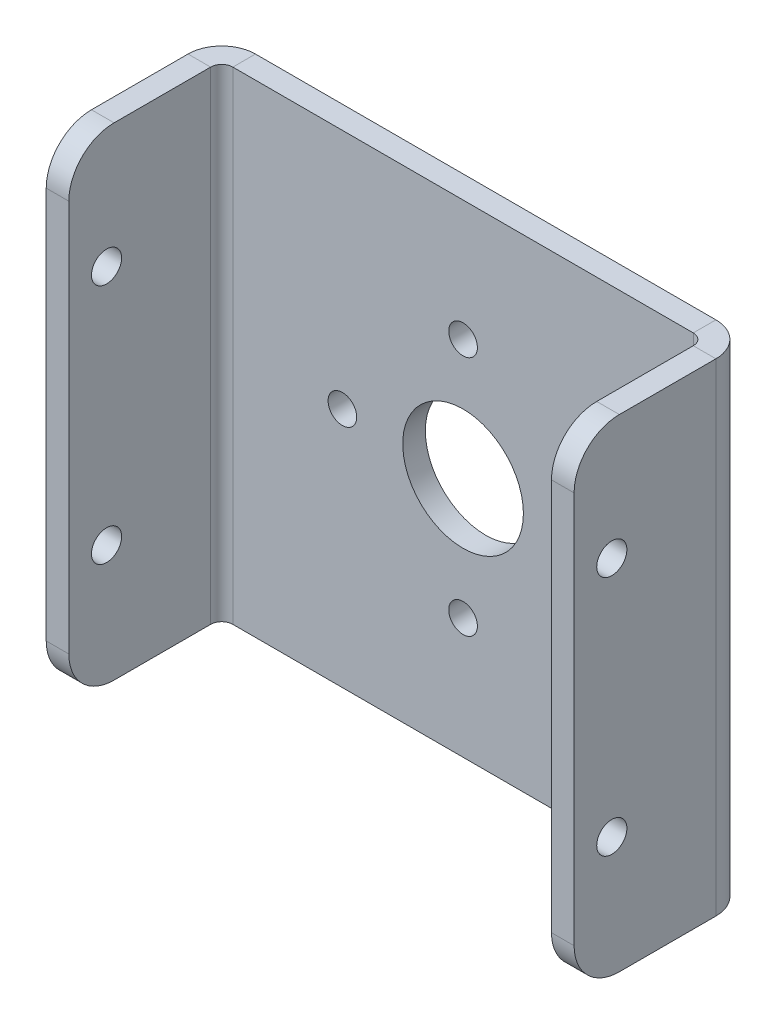
ISO-10303-21;
HEADER;
FILE_DESCRIPTION(('STEP AP214'),'2;1');
FILE_NAME('part.step','',(''),(''),'','','');
FILE_SCHEMA(('AUTOMOTIVE_DESIGN { 1 0 10303 214 1 1 1 1 }'));
ENDSEC;
DATA;
#1=APPLICATION_CONTEXT('core data for automotive mechanical design processes');
#2=APPLICATION_PROTOCOL_DEFINITION('international standard','automotive_design',2000,#1);
#3=PRODUCT_CONTEXT('',#1,'mechanical');
#4=PRODUCT('Part','Part','',(#3));
#5=PRODUCT_RELATED_PRODUCT_CATEGORY('part','',(#4));
#6=PRODUCT_DEFINITION_FORMATION('','',#4);
#7=PRODUCT_DEFINITION_CONTEXT('part definition',#1,'design');
#8=PRODUCT_DEFINITION('design','',#6,#7);
#9=PRODUCT_DEFINITION_SHAPE('','',#8);
#10=(LENGTH_UNIT() NAMED_UNIT(*) SI_UNIT(.MILLI.,.METRE.));
#11=(NAMED_UNIT(*) PLANE_ANGLE_UNIT() SI_UNIT($,.RADIAN.));
#12=(NAMED_UNIT(*) SI_UNIT($,.STERADIAN.) SOLID_ANGLE_UNIT());
#13=UNCERTAINTY_MEASURE_WITH_UNIT(LENGTH_MEASURE(1.E-05),#10,'distance_accuracy_value','');
#14=(GEOMETRIC_REPRESENTATION_CONTEXT(3) GLOBAL_UNCERTAINTY_ASSIGNED_CONTEXT((#13)) GLOBAL_UNIT_ASSIGNED_CONTEXT((#10,
#11,#12)) REPRESENTATION_CONTEXT('',''));
#15=CARTESIAN_POINT('',(0.,0.,0.));
#16=DIRECTION('',(0.,0.,1.));
#17=DIRECTION('',(1.,0.,0.));
#18=AXIS2_PLACEMENT_3D('',#15,#16,#17);
#19=CARTESIAN_POINT('',(24.,13.,-1.5));
#20=DIRECTION('',(0.,0.,-1.));
#21=DIRECTION('',(-1.,0.,0.));
#22=AXIS2_PLACEMENT_3D('',#19,#20,#21);
#23=PLANE('',#22);
#24=CARTESIAN_POINT('',(-7.99999999999977,-2.27373675443232E-13,-1.5));
#25=DIRECTION('',(0.,0.,-1.));
#26=DIRECTION('',(-1.,0.,0.));
#27=AXIS2_PLACEMENT_3D('',#24,#25,#26);
#28=CIRCLE('',#27,0.950000000000363);
#29=CARTESIAN_POINT('',(-8.95000000000014,-2.27373675443232E-13,-1.5));
#30=VERTEX_POINT('',#29);
#31=EDGE_CURVE('E487',#30,#30,#28,.T.);
#32=ORIENTED_EDGE('',*,*,#31,.F.);
#33=EDGE_LOOP('',(#32));
#34=FACE_BOUND('',#33,.T.);
#35=CARTESIAN_POINT('',(4.52787916007828E-13,-8.,-1.5));
#36=DIRECTION('',(0.,0.,-1.));
#37=DIRECTION('',(-1.,0.,0.));
#38=AXIS2_PLACEMENT_3D('',#35,#36,#37);
#39=CIRCLE('',#38,0.950000000000486);
#40=CARTESIAN_POINT('',(-0.950000000000033,-8.,-1.5));
#41=VERTEX_POINT('',#40);
#42=EDGE_CURVE('E474',#41,#41,#39,.T.);
#43=ORIENTED_EDGE('',*,*,#42,.F.);
#44=EDGE_LOOP('',(#43));
#45=FACE_BOUND('',#44,.T.);
#46=CARTESIAN_POINT('',(8.00000000000023,2.26393958003914E-13,-1.5));
#47=DIRECTION('',(0.,0.,-1.));
#48=DIRECTION('',(-1.,0.,0.));
#49=AXIS2_PLACEMENT_3D('',#46,#47,#48);
#50=CIRCLE('',#49,0.950000000000177);
#51=CARTESIAN_POINT('',(7.05000000000005,2.26393958003914E-13,-1.5));
#52=VERTEX_POINT('',#51);
#53=EDGE_CURVE('E483',#52,#52,#50,.T.);
#54=ORIENTED_EDGE('',*,*,#53,.F.);
#55=EDGE_LOOP('',(#54));
#56=FACE_BOUND('',#55,.T.);
#57=CARTESIAN_POINT('',(0.,8.,-1.5));
#58=DIRECTION('',(0.,0.,-1.));
#59=DIRECTION('',(-1.,0.,0.));
#60=AXIS2_PLACEMENT_3D('',#57,#58,#59);
#61=CIRCLE('',#60,0.95);
#62=CARTESIAN_POINT('',(-0.95,8.,-1.5));
#63=VERTEX_POINT('',#62);
#64=EDGE_CURVE('E479',#63,#63,#61,.T.);
#65=ORIENTED_EDGE('',*,*,#64,.F.);
#66=EDGE_LOOP('',(#65));
#67=FACE_BOUND('',#66,.T.);
#68=CARTESIAN_POINT('',(0.,0.,-1.5));
#69=DIRECTION('',(0.,0.,-1.));
#70=DIRECTION('',(-1.,0.,0.));
#71=AXIS2_PLACEMENT_3D('',#68,#69,#70);
#72=CIRCLE('',#71,4.);
#73=CARTESIAN_POINT('',(-4.,0.,-1.5));
#74=VERTEX_POINT('',#73);
#75=EDGE_CURVE('E491',#74,#74,#72,.T.);
#76=ORIENTED_EDGE('',*,*,#75,.F.);
#77=EDGE_LOOP('',(#76));
#78=FACE_BOUND('',#77,.T.);
#79=DIRECTION('',(-1.,0.,0.));
#80=VECTOR('',#79,1.);
#81=CARTESIAN_POINT('',(-24.,16.,-1.5));
#82=LINE('',#81,#80);
#83=CARTESIAN_POINT('',(15.2634,16.,-1.5));
#84=VERTEX_POINT('',#83);
#85=CARTESIAN_POINT('',(-15.2634,16.,-1.5));
#86=VERTEX_POINT('',#85);
#87=EDGE_CURVE('E291',#84,#86,#82,.T.);
#88=ORIENTED_EDGE('',*,*,#87,.F.);
#89=DIRECTION('',(0.,-1.,0.));
#90=VECTOR('',#89,1.);
#91=CARTESIAN_POINT('',(15.2634,13.,-1.5));
#92=LINE('',#91,#90);
#93=CARTESIAN_POINT('',(15.2634,-16.,-1.5));
#94=VERTEX_POINT('',#93);
#95=EDGE_CURVE('E282',#84,#94,#92,.T.);
#96=ORIENTED_EDGE('',*,*,#95,.T.);
#97=DIRECTION('',(1.,0.,0.));
#98=VECTOR('',#97,1.);
#99=CARTESIAN_POINT('',(-24.,-16.,-1.5));
#100=LINE('',#99,#98);
#101=CARTESIAN_POINT('',(-15.2634,-16.,-1.5));
#102=VERTEX_POINT('',#101);
#103=EDGE_CURVE('E274',#102,#94,#100,.T.);
#104=ORIENTED_EDGE('',*,*,#103,.F.);
#105=DIRECTION('',(0.,-1.,0.));
#106=VECTOR('',#105,1.);
#107=CARTESIAN_POINT('',(-15.2634,13.,-1.5));
#108=LINE('',#107,#106);
#109=EDGE_CURVE('E270',#86,#102,#108,.T.);
#110=ORIENTED_EDGE('',*,*,#109,.F.);
#111=EDGE_LOOP('',(#88,#96,#104,#110));
#112=FACE_BOUND('',#111,.T.);
#113=ADVANCED_FACE('F48',(#34,#45,#56,#67,#78,#112),#23,.T.);
#114=CARTESIAN_POINT('',(-24.,16.,-1.5));
#115=DIRECTION('',(0.,1.,0.));
#116=DIRECTION('',(0.,0.,1.));
#117=AXIS2_PLACEMENT_3D('',#114,#115,#116);
#118=PLANE('',#117);
#119=DIRECTION('',(-1.,0.,0.));
#120=VECTOR('',#119,1.);
#121=CARTESIAN_POINT('',(-24.,16.,0.));
#122=LINE('',#121,#120);
#123=CARTESIAN_POINT('',(15.2634,16.,0.));
#124=VERTEX_POINT('',#123);
#125=CARTESIAN_POINT('',(-15.2634,16.,0.));
#126=VERTEX_POINT('',#125);
#127=EDGE_CURVE('E71',#124,#126,#122,.T.);
#128=ORIENTED_EDGE('',*,*,#127,.F.);
#129=DIRECTION('',(0.,0.,-1.));
#130=VECTOR('',#129,1.);
#131=CARTESIAN_POINT('',(15.2634,16.,-1.5));
#132=LINE('',#131,#130);
#133=EDGE_CURVE('E285',#124,#84,#132,.T.);
#134=ORIENTED_EDGE('',*,*,#133,.T.);
#135=ORIENTED_EDGE('',*,*,#87,.T.);
#136=DIRECTION('',(0.,0.,-1.));
#137=VECTOR('',#136,1.);
#138=CARTESIAN_POINT('',(-15.2634,16.,-1.5));
#139=LINE('',#138,#137);
#140=EDGE_CURVE('E279',#126,#86,#139,.T.);
#141=ORIENTED_EDGE('',*,*,#140,.F.);
#142=EDGE_LOOP('',(#128,#134,#135,#141));
#143=FACE_BOUND('',#142,.T.);
#144=ADVANCED_FACE('F362',(#143),#118,.T.);
#145=CARTESIAN_POINT('',(-24.,-16.,-1.5));
#146=DIRECTION('',(0.,-1.,0.));
#147=DIRECTION('',(0.,0.,-1.));
#148=AXIS2_PLACEMENT_3D('',#145,#146,#147);
#149=PLANE('',#148);
#150=ORIENTED_EDGE('',*,*,#103,.T.);
#151=DIRECTION('',(0.,0.,1.));
#152=VECTOR('',#151,1.);
#153=CARTESIAN_POINT('',(15.2634,-16.,-1.5));
#154=LINE('',#153,#152);
#155=CARTESIAN_POINT('',(15.2634,-16.,0.));
#156=VERTEX_POINT('',#155);
#157=EDGE_CURVE('E12',#94,#156,#154,.T.);
#158=ORIENTED_EDGE('',*,*,#157,.T.);
#159=DIRECTION('',(1.,0.,0.));
#160=VECTOR('',#159,1.);
#161=CARTESIAN_POINT('',(-24.,-16.,0.));
#162=LINE('',#161,#160);
#163=CARTESIAN_POINT('',(-15.2634,-16.,0.));
#164=VERTEX_POINT('',#163);
#165=EDGE_CURVE('E292',#164,#156,#162,.T.);
#166=ORIENTED_EDGE('',*,*,#165,.F.);
#167=DIRECTION('',(0.,0.,1.));
#168=VECTOR('',#167,1.);
#169=CARTESIAN_POINT('',(-15.2634,-16.,-1.5));
#170=LINE('',#169,#168);
#171=EDGE_CURVE('E273',#102,#164,#170,.T.);
#172=ORIENTED_EDGE('',*,*,#171,.F.);
#173=EDGE_LOOP('',(#150,#158,#166,#172));
#174=FACE_BOUND('',#173,.T.);
#175=ADVANCED_FACE('F50',(#174),#149,.T.);
#176=CARTESIAN_POINT('',(24.,13.,0.));
#177=DIRECTION('',(0.,0.,-1.));
#178=DIRECTION('',(-1.,0.,0.));
#179=AXIS2_PLACEMENT_3D('',#176,#177,#178);
#180=PLANE('',#179);
#181=CARTESIAN_POINT('',(-7.99999999999977,-2.27373675443232E-13,0.));
#182=DIRECTION('',(0.,0.,1.));
#183=DIRECTION('',(1.,0.,0.));
#184=AXIS2_PLACEMENT_3D('',#181,#182,#183);
#185=CIRCLE('',#184,0.950000000000363);
#186=CARTESIAN_POINT('',(-7.04999999999941,-2.27373675443232E-13,0.));
#187=VERTEX_POINT('',#186);
#188=EDGE_CURVE('E388',#187,#187,#185,.T.);
#189=ORIENTED_EDGE('',*,*,#188,.F.);
#190=EDGE_LOOP('',(#189));
#191=FACE_BOUND('',#190,.T.);
#192=CARTESIAN_POINT('',(4.52787916007828E-13,-8.,0.));
#193=DIRECTION('',(0.,0.,1.));
#194=DIRECTION('',(1.,0.,0.));
#195=AXIS2_PLACEMENT_3D('',#192,#193,#194);
#196=CIRCLE('',#195,0.950000000000486);
#197=CARTESIAN_POINT('',(0.950000000000939,-8.,0.));
#198=VERTEX_POINT('',#197);
#199=EDGE_CURVE('E392',#198,#198,#196,.T.);
#200=ORIENTED_EDGE('',*,*,#199,.F.);
#201=EDGE_LOOP('',(#200));
#202=FACE_BOUND('',#201,.T.);
#203=CARTESIAN_POINT('',(8.00000000000023,2.26393958003914E-13,0.));
#204=DIRECTION('',(0.,0.,1.));
#205=DIRECTION('',(1.,0.,0.));
#206=AXIS2_PLACEMENT_3D('',#203,#204,#205);
#207=CIRCLE('',#206,0.950000000000177);
#208=CARTESIAN_POINT('',(8.9500000000004,2.26393958003914E-13,0.));
#209=VERTEX_POINT('',#208);
#210=EDGE_CURVE('E396',#209,#209,#207,.T.);
#211=ORIENTED_EDGE('',*,*,#210,.F.);
#212=EDGE_LOOP('',(#211));
#213=FACE_BOUND('',#212,.T.);
#214=CARTESIAN_POINT('',(0.,8.,0.));
#215=DIRECTION('',(0.,0.,1.));
#216=DIRECTION('',(1.,0.,0.));
#217=AXIS2_PLACEMENT_3D('',#214,#215,#216);
#218=CIRCLE('',#217,0.95);
#219=CARTESIAN_POINT('',(0.95,8.,0.));
#220=VERTEX_POINT('',#219);
#221=EDGE_CURVE('E400',#220,#220,#218,.T.);
#222=ORIENTED_EDGE('',*,*,#221,.F.);
#223=EDGE_LOOP('',(#222));
#224=FACE_BOUND('',#223,.T.);
#225=CARTESIAN_POINT('',(0.,0.,0.));
#226=DIRECTION('',(0.,0.,1.));
#227=DIRECTION('',(1.,0.,0.));
#228=AXIS2_PLACEMENT_3D('',#225,#226,#227);
#229=CIRCLE('',#228,4.);
#230=CARTESIAN_POINT('',(4.,0.,0.));
#231=VERTEX_POINT('',#230);
#232=EDGE_CURVE('E403',#231,#231,#229,.T.);
#233=ORIENTED_EDGE('',*,*,#232,.F.);
#234=EDGE_LOOP('',(#233));
#235=FACE_BOUND('',#234,.T.);
#236=DIRECTION('',(0.,-1.,0.));
#237=VECTOR('',#236,1.);
#238=CARTESIAN_POINT('',(15.2634,13.,0.));
#239=LINE('',#238,#237);
#240=EDGE_CURVE('E57',#124,#156,#239,.T.);
#241=ORIENTED_EDGE('',*,*,#240,.F.);
#242=ORIENTED_EDGE('',*,*,#127,.T.);
#243=DIRECTION('',(0.,-1.,0.));
#244=VECTOR('',#243,1.);
#245=CARTESIAN_POINT('',(-15.2634,13.,0.));
#246=LINE('',#245,#244);
#247=EDGE_CURVE('E277',#126,#164,#246,.T.);
#248=ORIENTED_EDGE('',*,*,#247,.T.);
#249=ORIENTED_EDGE('',*,*,#165,.T.);
#250=EDGE_LOOP('',(#241,#242,#248,#249));
#251=FACE_BOUND('',#250,.T.);
#252=ADVANCED_FACE('F375',(#191,#202,#213,#224,#235,#251),#180,.F.);
#253=CARTESIAN_POINT('',(-15.2634,16.,0.7366));
#254=DIRECTION('',(0.,1.,0.));
#255=DIRECTION('',(0.,0.,1.));
#256=AXIS2_PLACEMENT_3D('',#253,#254,#255);
#257=PLANE('',#256);
#258=DIRECTION('',(-1.,0.,0.));
#259=VECTOR('',#258,1.);
#260=CARTESIAN_POINT('',(-17.5,16.,0.736600000000007));
#261=LINE('',#260,#259);
#262=CARTESIAN_POINT('',(-16.,16.,0.7366));
#263=VERTEX_POINT('',#262);
#264=CARTESIAN_POINT('',(-17.5,16.,0.736600000000007));
#265=VERTEX_POINT('',#264);
#266=EDGE_CURVE('E219',#263,#265,#261,.T.);
#267=ORIENTED_EDGE('',*,*,#266,.F.);
#268=CARTESIAN_POINT('',(-15.2634,16.,0.7366));
#269=DIRECTION('',(0.,1.,0.));
#270=DIRECTION('',(-1.,0.,0.));
#271=AXIS2_PLACEMENT_3D('',#268,#269,#270);
#272=CIRCLE('',#271,0.7366);
#273=EDGE_CURVE('E216',#263,#126,#272,.F.);
#274=ORIENTED_EDGE('',*,*,#273,.T.);
#275=ORIENTED_EDGE('',*,*,#140,.T.);
#276=CARTESIAN_POINT('',(-15.2634,16.,0.7366));
#277=DIRECTION('',(0.,-1.,0.));
#278=DIRECTION('',(0.,0.,1.));
#279=AXIS2_PLACEMENT_3D('',#276,#277,#278);
#280=CIRCLE('',#279,2.2366);
#281=EDGE_CURVE('E259',#265,#86,#280,.T.);
#282=ORIENTED_EDGE('',*,*,#281,.F.);
#283=EDGE_LOOP('',(#267,#274,#275,#282));
#284=FACE_BOUND('',#283,.T.);
#285=ADVANCED_FACE('F377',(#284),#257,.T.);
#286=CARTESIAN_POINT('',(-15.2634,-16.,0.7366));
#287=DIRECTION('',(0.,-1.,0.));
#288=DIRECTION('',(0.,0.,-1.));
#289=AXIS2_PLACEMENT_3D('',#286,#287,#288);
#290=PLANE('',#289);
#291=CARTESIAN_POINT('',(-15.2634,-16.,0.7366));
#292=DIRECTION('',(0.,1.,0.));
#293=DIRECTION('',(-1.,0.,0.));
#294=AXIS2_PLACEMENT_3D('',#291,#292,#293);
#295=CIRCLE('',#294,0.7366);
#296=CARTESIAN_POINT('',(-16.,-16.,0.736600000000007));
#297=VERTEX_POINT('',#296);
#298=EDGE_CURVE('E263',#164,#297,#295,.T.);
#299=ORIENTED_EDGE('',*,*,#298,.T.);
#300=DIRECTION('',(1.,0.,0.));
#301=VECTOR('',#300,1.);
#302=CARTESIAN_POINT('',(-17.5,-16.,0.736600000000007));
#303=LINE('',#302,#301);
#304=CARTESIAN_POINT('',(-17.5,-16.,0.736600000000007));
#305=VERTEX_POINT('',#304);
#306=EDGE_CURVE('E234',#305,#297,#303,.T.);
#307=ORIENTED_EDGE('',*,*,#306,.F.);
#308=CARTESIAN_POINT('',(-15.2634,-16.,0.7366));
#309=DIRECTION('',(0.,1.,0.));
#310=DIRECTION('',(0.,0.,-1.));
#311=AXIS2_PLACEMENT_3D('',#308,#309,#310);
#312=CIRCLE('',#311,2.2366);
#313=EDGE_CURVE('E262',#102,#305,#312,.T.);
#314=ORIENTED_EDGE('',*,*,#313,.F.);
#315=ORIENTED_EDGE('',*,*,#171,.T.);
#316=EDGE_LOOP('',(#299,#307,#314,#315));
#317=FACE_BOUND('',#316,.T.);
#318=ADVANCED_FACE('F373',(#317),#290,.T.);
#319=CARTESIAN_POINT('',(-15.2634,-32.1201324094083,0.7366));
#320=DIRECTION('',(0.,1.,0.));
#321=DIRECTION('',(-1.,0.,0.));
#322=AXIS2_PLACEMENT_3D('',#319,#320,#321);
#323=CYLINDRICAL_SURFACE('',#322,2.2366);
#324=ORIENTED_EDGE('',*,*,#109,.T.);
#325=ORIENTED_EDGE('',*,*,#313,.T.);
#326=DIRECTION('',(0.,-1.,0.));
#327=VECTOR('',#326,1.);
#328=CARTESIAN_POINT('',(-17.5,13.,0.736600000000011));
#329=LINE('',#328,#327);
#330=EDGE_CURVE('E240',#265,#305,#329,.T.);
#331=ORIENTED_EDGE('',*,*,#330,.F.);
#332=ORIENTED_EDGE('',*,*,#281,.T.);
#333=EDGE_LOOP('',(#324,#325,#331,#332));
#334=FACE_BOUND('',#333,.T.);
#335=ADVANCED_FACE('F518',(#334),#323,.T.);
#336=CARTESIAN_POINT('',(-15.2634,-32.1201324094083,0.7366));
#337=DIRECTION('',(0.,1.,0.));
#338=DIRECTION('',(-1.,0.,0.));
#339=AXIS2_PLACEMENT_3D('',#336,#337,#338);
#340=CYLINDRICAL_SURFACE('',#339,0.7366);
#341=ORIENTED_EDGE('',*,*,#247,.F.);
#342=ORIENTED_EDGE('',*,*,#273,.F.);
#343=DIRECTION('',(0.,-1.,0.));
#344=VECTOR('',#343,1.);
#345=CARTESIAN_POINT('',(-16.,13.,0.736600000000004));
#346=LINE('',#345,#344);
#347=EDGE_CURVE('E209',#263,#297,#346,.T.);
#348=ORIENTED_EDGE('',*,*,#347,.T.);
#349=ORIENTED_EDGE('',*,*,#298,.F.);
#350=EDGE_LOOP('',(#341,#342,#348,#349));
#351=FACE_BOUND('',#350,.T.);
#352=ADVANCED_FACE('F524',(#351),#340,.F.);
#353=CARTESIAN_POINT('',(-17.5,13.,7.13805418058671));
#354=DIRECTION('',(1.,0.,0.));
#355=DIRECTION('',(0.,0.,-1.));
#356=AXIS2_PLACEMENT_3D('',#353,#354,#355);
#357=CYLINDRICAL_SURFACE('',#356,3.);
#358=CARTESIAN_POINT('',(-16.,13.,7.1380541805867));
#359=DIRECTION('',(1.,0.,0.));
#360=DIRECTION('',(0.,0.,1.));
#361=AXIS2_PLACEMENT_3D('',#358,#359,#360);
#362=CIRCLE('',#361,3.);
#363=CARTESIAN_POINT('',(-16.,16.,7.1380541805867));
#364=VERTEX_POINT('',#363);
#365=CARTESIAN_POINT('',(-16.,13.,10.1380541805867));
#366=VERTEX_POINT('',#365);
#367=EDGE_CURVE('E229',#364,#366,#362,.T.);
#368=ORIENTED_EDGE('',*,*,#367,.F.);
#369=DIRECTION('',(1.,0.,0.));
#370=VECTOR('',#369,1.);
#371=CARTESIAN_POINT('',(-17.5,16.,7.13805418058671));
#372=LINE('',#371,#370);
#373=CARTESIAN_POINT('',(-17.5,16.,7.13805418058671));
#374=VERTEX_POINT('',#373);
#375=EDGE_CURVE('E213',#374,#364,#372,.T.);
#376=ORIENTED_EDGE('',*,*,#375,.F.);
#377=CARTESIAN_POINT('',(-17.5,13.,7.13805418058671));
#378=DIRECTION('',(1.,0.,0.));
#379=DIRECTION('',(0.,0.,1.));
#380=AXIS2_PLACEMENT_3D('',#377,#378,#379);
#381=CIRCLE('',#380,3.);
#382=CARTESIAN_POINT('',(-17.5,13.,10.1380541805867));
#383=VERTEX_POINT('',#382);
#384=EDGE_CURVE('E254',#374,#383,#381,.T.);
#385=ORIENTED_EDGE('',*,*,#384,.T.);
#386=DIRECTION('',(1.,0.,0.));
#387=VECTOR('',#386,1.);
#388=CARTESIAN_POINT('',(-17.5,13.,10.1380541805867));
#389=LINE('',#388,#387);
#390=EDGE_CURVE('E252',#383,#366,#389,.T.);
#391=ORIENTED_EDGE('',*,*,#390,.T.);
#392=EDGE_LOOP('',(#368,#376,#385,#391));
#393=FACE_BOUND('',#392,.T.);
#394=ADVANCED_FACE('F538',(#393),#357,.T.);
#395=CARTESIAN_POINT('',(-17.5,-13.,10.1380541805867));
#396=DIRECTION('',(0.,0.,1.));
#397=DIRECTION('',(1.,0.,0.));
#398=AXIS2_PLACEMENT_3D('',#395,#396,#397);
#399=PLANE('',#398);
#400=DIRECTION('',(0.,-1.,0.));
#401=VECTOR('',#400,1.);
#402=CARTESIAN_POINT('',(-16.,-13.,10.1380541805867));
#403=LINE('',#402,#401);
#404=CARTESIAN_POINT('',(-16.,-13.,10.1380541805867));
#405=VERTEX_POINT('',#404);
#406=EDGE_CURVE('E226',#366,#405,#403,.T.);
#407=ORIENTED_EDGE('',*,*,#406,.F.);
#408=ORIENTED_EDGE('',*,*,#390,.F.);
#409=DIRECTION('',(0.,-1.,0.));
#410=VECTOR('',#409,1.);
#411=CARTESIAN_POINT('',(-17.5,-13.,10.1380541805867));
#412=LINE('',#411,#410);
#413=CARTESIAN_POINT('',(-17.5,-13.,10.1380541805867));
#414=VERTEX_POINT('',#413);
#415=EDGE_CURVE('E249',#383,#414,#412,.T.);
#416=ORIENTED_EDGE('',*,*,#415,.T.);
#417=DIRECTION('',(1.,0.,0.));
#418=VECTOR('',#417,1.);
#419=CARTESIAN_POINT('',(-17.5,-13.,10.1380541805867));
#420=LINE('',#419,#418);
#421=EDGE_CURVE('E247',#414,#405,#420,.T.);
#422=ORIENTED_EDGE('',*,*,#421,.T.);
#423=EDGE_LOOP('',(#407,#408,#416,#422));
#424=FACE_BOUND('',#423,.T.);
#425=ADVANCED_FACE('F535',(#424),#399,.T.);
#426=CARTESIAN_POINT('',(-17.5,-13.,7.13805418058671));
#427=DIRECTION('',(1.,0.,0.));
#428=DIRECTION('',(0.,0.,-1.));
#429=AXIS2_PLACEMENT_3D('',#426,#427,#428);
#430=CYLINDRICAL_SURFACE('',#429,3.);
#431=CARTESIAN_POINT('',(-16.,-13.,7.13805418058671));
#432=DIRECTION('',(1.,0.,0.));
#433=DIRECTION('',(0.,0.,1.));
#434=AXIS2_PLACEMENT_3D('',#431,#432,#433);
#435=CIRCLE('',#434,3.);
#436=CARTESIAN_POINT('',(-16.,-16.,7.13805418058671));
#437=VERTEX_POINT('',#436);
#438=EDGE_CURVE('E223',#405,#437,#435,.T.);
#439=ORIENTED_EDGE('',*,*,#438,.F.);
#440=ORIENTED_EDGE('',*,*,#421,.F.);
#441=CARTESIAN_POINT('',(-17.5,-13.,7.13805418058671));
#442=DIRECTION('',(1.,0.,0.));
#443=DIRECTION('',(0.,0.,1.));
#444=AXIS2_PLACEMENT_3D('',#441,#442,#443);
#445=CIRCLE('',#444,3.);
#446=CARTESIAN_POINT('',(-17.5,-16.,7.13805418058671));
#447=VERTEX_POINT('',#446);
#448=EDGE_CURVE('E244',#414,#447,#445,.T.);
#449=ORIENTED_EDGE('',*,*,#448,.T.);
#450=DIRECTION('',(1.,0.,0.));
#451=VECTOR('',#450,1.);
#452=CARTESIAN_POINT('',(-17.5,-16.,7.13805418058671));
#453=LINE('',#452,#451);
#454=EDGE_CURVE('E242',#447,#437,#453,.T.);
#455=ORIENTED_EDGE('',*,*,#454,.T.);
#456=EDGE_LOOP('',(#439,#440,#449,#455));
#457=FACE_BOUND('',#456,.T.);
#458=ADVANCED_FACE('F505',(#457),#430,.T.);
#459=CARTESIAN_POINT('',(-17.5000000000002,13.,-40.8619458194133));
#460=DIRECTION('',(-1.,0.,0.));
#461=DIRECTION('',(0.,0.,1.));
#462=AXIS2_PLACEMENT_3D('',#459,#460,#461);
#463=PLANE('',#462);
#464=CARTESIAN_POINT('',(-17.5,-8.,7.63805418058671));
#465=DIRECTION('',(-1.,0.,0.));
#466=DIRECTION('',(0.,0.,1.));
#467=AXIS2_PLACEMENT_3D('',#464,#465,#466);
#468=CIRCLE('',#467,1.);
#469=CARTESIAN_POINT('',(-17.5,-8.,8.63805418058671));
#470=VERTEX_POINT('',#469);
#471=EDGE_CURVE('E494',#470,#470,#468,.T.);
#472=ORIENTED_EDGE('',*,*,#471,.F.);
#473=EDGE_LOOP('',(#472));
#474=FACE_BOUND('',#473,.T.);
#475=CARTESIAN_POINT('',(-17.5,8.,7.63805418058671));
#476=DIRECTION('',(-1.,0.,0.));
#477=DIRECTION('',(0.,0.,1.));
#478=AXIS2_PLACEMENT_3D('',#475,#476,#477);
#479=CIRCLE('',#478,1.);
#480=CARTESIAN_POINT('',(-17.5,8.,8.63805418058671));
#481=VERTEX_POINT('',#480);
#482=EDGE_CURVE('E305',#481,#481,#479,.T.);
#483=ORIENTED_EDGE('',*,*,#482,.F.);
#484=EDGE_LOOP('',(#483));
#485=FACE_BOUND('',#484,.T.);
#486=DIRECTION('',(0.,0.,1.));
#487=VECTOR('',#486,1.);
#488=CARTESIAN_POINT('',(-17.5,16.,7.13805418058671));
#489=LINE('',#488,#487);
#490=EDGE_CURVE('E217',#265,#374,#489,.T.);
#491=ORIENTED_EDGE('',*,*,#490,.F.);
#492=ORIENTED_EDGE('',*,*,#330,.T.);
#493=DIRECTION('',(0.,0.,-1.));
#494=VECTOR('',#493,1.);
#495=CARTESIAN_POINT('',(-17.5,-16.,7.13805418058671));
#496=LINE('',#495,#494);
#497=EDGE_CURVE('E237',#447,#305,#496,.T.);
#498=ORIENTED_EDGE('',*,*,#497,.F.);
#499=ORIENTED_EDGE('',*,*,#448,.F.);
#500=ORIENTED_EDGE('',*,*,#415,.F.);
#501=ORIENTED_EDGE('',*,*,#384,.F.);
#502=EDGE_LOOP('',(#491,#492,#498,#499,#500,#501));
#503=FACE_BOUND('',#502,.T.);
#504=ADVANCED_FACE('F501',(#474,#485,#503),#463,.T.);
#505=CARTESIAN_POINT('',(-17.5,-16.,7.13805418058671));
#506=DIRECTION('',(0.,-1.,0.));
#507=DIRECTION('',(-1.,0.,0.));
#508=AXIS2_PLACEMENT_3D('',#505,#506,#507);
#509=PLANE('',#508);
#510=ORIENTED_EDGE('',*,*,#497,.T.);
#511=ORIENTED_EDGE('',*,*,#306,.T.);
#512=DIRECTION('',(0.,0.,-1.));
#513=VECTOR('',#512,1.);
#514=CARTESIAN_POINT('',(-16.,-16.,7.13805418058671));
#515=LINE('',#514,#513);
#516=EDGE_CURVE('E221',#437,#297,#515,.T.);
#517=ORIENTED_EDGE('',*,*,#516,.F.);
#518=ORIENTED_EDGE('',*,*,#454,.F.);
#519=EDGE_LOOP('',(#510,#511,#517,#518));
#520=FACE_BOUND('',#519,.T.);
#521=ADVANCED_FACE('F504',(#520),#509,.T.);
#522=CARTESIAN_POINT('',(-16.0000000000002,13.,-40.8619458194133));
#523=DIRECTION('',(-1.,0.,0.));
#524=DIRECTION('',(0.,0.,1.));
#525=AXIS2_PLACEMENT_3D('',#522,#523,#524);
#526=PLANE('',#525);
#527=CARTESIAN_POINT('',(-16.,-8.,7.6380541805867));
#528=DIRECTION('',(-1.,0.,0.));
#529=DIRECTION('',(0.,0.,1.));
#530=AXIS2_PLACEMENT_3D('',#527,#528,#529);
#531=CIRCLE('',#530,1.);
#532=CARTESIAN_POINT('',(-16.,-8.,8.6380541805867));
#533=VERTEX_POINT('',#532);
#534=EDGE_CURVE('E310',#533,#533,#531,.T.);
#535=ORIENTED_EDGE('',*,*,#534,.T.);
#536=EDGE_LOOP('',(#535));
#537=FACE_BOUND('',#536,.T.);
#538=CARTESIAN_POINT('',(-16.,8.,7.6380541805867));
#539=DIRECTION('',(-1.,0.,0.));
#540=DIRECTION('',(0.,0.,1.));
#541=AXIS2_PLACEMENT_3D('',#538,#539,#540);
#542=CIRCLE('',#541,1.);
#543=CARTESIAN_POINT('',(-16.,8.,8.6380541805867));
#544=VERTEX_POINT('',#543);
#545=EDGE_CURVE('E201',#544,#544,#542,.T.);
#546=ORIENTED_EDGE('',*,*,#545,.T.);
#547=EDGE_LOOP('',(#546));
#548=FACE_BOUND('',#547,.T.);
#549=ORIENTED_EDGE('',*,*,#347,.F.);
#550=DIRECTION('',(0.,0.,1.));
#551=VECTOR('',#550,1.);
#552=CARTESIAN_POINT('',(-16.,16.,7.1380541805867));
#553=LINE('',#552,#551);
#554=EDGE_CURVE('E232',#263,#364,#553,.T.);
#555=ORIENTED_EDGE('',*,*,#554,.T.);
#556=ORIENTED_EDGE('',*,*,#367,.T.);
#557=ORIENTED_EDGE('',*,*,#406,.T.);
#558=ORIENTED_EDGE('',*,*,#438,.T.);
#559=ORIENTED_EDGE('',*,*,#516,.T.);
#560=EDGE_LOOP('',(#549,#555,#556,#557,#558,#559));
#561=FACE_BOUND('',#560,.T.);
#562=ADVANCED_FACE('F541',(#537,#548,#561),#526,.F.);
#563=CARTESIAN_POINT('',(-17.5,16.,7.13805418058671));
#564=DIRECTION('',(0.,1.,0.));
#565=DIRECTION('',(1.,0.,0.));
#566=AXIS2_PLACEMENT_3D('',#563,#564,#565);
#567=PLANE('',#566);
#568=ORIENTED_EDGE('',*,*,#554,.F.);
#569=ORIENTED_EDGE('',*,*,#266,.T.);
#570=ORIENTED_EDGE('',*,*,#490,.T.);
#571=ORIENTED_EDGE('',*,*,#375,.T.);
#572=EDGE_LOOP('',(#568,#569,#570,#571));
#573=FACE_BOUND('',#572,.T.);
#574=ADVANCED_FACE('F539',(#573),#567,.T.);
#575=CARTESIAN_POINT('',(15.2634,16.,0.7366));
#576=DIRECTION('',(0.,1.,0.));
#577=DIRECTION('',(0.,0.,1.));
#578=AXIS2_PLACEMENT_3D('',#575,#576,#577);
#579=PLANE('',#578);
#580=ORIENTED_EDGE('',*,*,#133,.F.);
#581=CARTESIAN_POINT('',(15.2634,16.,0.7366));
#582=DIRECTION('',(0.,-1.,0.));
#583=DIRECTION('',(1.,0.,0.));
#584=AXIS2_PLACEMENT_3D('',#581,#582,#583);
#585=CIRCLE('',#584,0.7366);
#586=CARTESIAN_POINT('',(16.,16.,0.736600000000007));
#587=VERTEX_POINT('',#586);
#588=EDGE_CURVE('E184',#124,#587,#585,.T.);
#589=ORIENTED_EDGE('',*,*,#588,.T.);
#590=DIRECTION('',(1.,0.,0.));
#591=VECTOR('',#590,1.);
#592=CARTESIAN_POINT('',(17.5,16.,0.736600000000014));
#593=LINE('',#592,#591);
#594=CARTESIAN_POINT('',(17.5,16.,0.736600000000014));
#595=VERTEX_POINT('',#594);
#596=EDGE_CURVE('E191',#587,#595,#593,.T.);
#597=ORIENTED_EDGE('',*,*,#596,.T.);
#598=CARTESIAN_POINT('',(15.2634,16.,0.7366));
#599=DIRECTION('',(0.,-1.,0.));
#600=DIRECTION('',(0.,0.,1.));
#601=AXIS2_PLACEMENT_3D('',#598,#599,#600);
#602=CIRCLE('',#601,2.2366);
#603=EDGE_CURVE('E202',#84,#595,#602,.T.);
#604=ORIENTED_EDGE('',*,*,#603,.F.);
#605=EDGE_LOOP('',(#580,#589,#597,#604));
#606=FACE_BOUND('',#605,.T.);
#607=ADVANCED_FACE('F410',(#606),#579,.T.);
#608=CARTESIAN_POINT('',(15.2634,-16.,0.7366));
#609=DIRECTION('',(0.,-1.,0.));
#610=DIRECTION('',(0.,0.,-1.));
#611=AXIS2_PLACEMENT_3D('',#608,#609,#610);
#612=PLANE('',#611);
#613=DIRECTION('',(-1.,0.,0.));
#614=VECTOR('',#613,1.);
#615=CARTESIAN_POINT('',(17.5,-16.,0.736600000000007));
#616=LINE('',#615,#614);
#617=CARTESIAN_POINT('',(17.5,-16.,0.736599999999994));
#618=VERTEX_POINT('',#617);
#619=CARTESIAN_POINT('',(16.,-16.,0.7366));
#620=VERTEX_POINT('',#619);
#621=EDGE_CURVE('E171',#618,#620,#616,.T.);
#622=ORIENTED_EDGE('',*,*,#621,.T.);
#623=CARTESIAN_POINT('',(15.2634,-16.,0.7366));
#624=DIRECTION('',(0.,-1.,0.));
#625=DIRECTION('',(1.,0.,0.));
#626=AXIS2_PLACEMENT_3D('',#623,#624,#625);
#627=CIRCLE('',#626,0.7366);
#628=EDGE_CURVE('E206',#620,#156,#627,.F.);
#629=ORIENTED_EDGE('',*,*,#628,.T.);
#630=ORIENTED_EDGE('',*,*,#157,.F.);
#631=CARTESIAN_POINT('',(15.2634,-16.,0.7366));
#632=DIRECTION('',(0.,1.,0.));
#633=DIRECTION('',(0.,0.,-1.));
#634=AXIS2_PLACEMENT_3D('',#631,#632,#633);
#635=CIRCLE('',#634,2.2366);
#636=EDGE_CURVE('E205',#618,#94,#635,.T.);
#637=ORIENTED_EDGE('',*,*,#636,.F.);
#638=EDGE_LOOP('',(#622,#629,#630,#637));
#639=FACE_BOUND('',#638,.T.);
#640=ADVANCED_FACE('F348',(#639),#612,.T.);
#641=CARTESIAN_POINT('',(15.2634,32.1201324094083,0.7366));
#642=DIRECTION('',(0.,-1.,0.));
#643=DIRECTION('',(1.,0.,0.));
#644=AXIS2_PLACEMENT_3D('',#641,#642,#643);
#645=CYLINDRICAL_SURFACE('',#644,2.2366);
#646=ORIENTED_EDGE('',*,*,#636,.T.);
#647=ORIENTED_EDGE('',*,*,#95,.F.);
#648=ORIENTED_EDGE('',*,*,#603,.T.);
#649=DIRECTION('',(0.,-1.,0.));
#650=VECTOR('',#649,1.);
#651=CARTESIAN_POINT('',(17.5,13.,0.736600000000014));
#652=LINE('',#651,#650);
#653=EDGE_CURVE('E199',#595,#618,#652,.T.);
#654=ORIENTED_EDGE('',*,*,#653,.T.);
#655=EDGE_LOOP('',(#646,#647,#648,#654));
#656=FACE_BOUND('',#655,.T.);
#657=ADVANCED_FACE('F351',(#656),#645,.T.);
#658=CARTESIAN_POINT('',(15.2634,32.1201324094083,0.7366));
#659=DIRECTION('',(0.,-1.,0.));
#660=DIRECTION('',(1.,0.,0.));
#661=AXIS2_PLACEMENT_3D('',#658,#659,#660);
#662=CYLINDRICAL_SURFACE('',#661,0.7366);
#663=ORIENTED_EDGE('',*,*,#628,.F.);
#664=DIRECTION('',(0.,-1.,0.));
#665=VECTOR('',#664,1.);
#666=CARTESIAN_POINT('',(16.,13.,0.736600000000007));
#667=LINE('',#666,#665);
#668=EDGE_CURVE('E323',#587,#620,#667,.T.);
#669=ORIENTED_EDGE('',*,*,#668,.F.);
#670=ORIENTED_EDGE('',*,*,#588,.F.);
#671=ORIENTED_EDGE('',*,*,#240,.T.);
#672=EDGE_LOOP('',(#663,#669,#670,#671));
#673=FACE_BOUND('',#672,.T.);
#674=ADVANCED_FACE('F349',(#673),#662,.F.);
#675=CARTESIAN_POINT('',(17.5,-13.,7.13805418058671));
#676=DIRECTION('',(-1.,0.,0.));
#677=DIRECTION('',(0.,0.,1.));
#678=AXIS2_PLACEMENT_3D('',#675,#676,#677);
#679=CYLINDRICAL_SURFACE('',#678,3.);
#680=CARTESIAN_POINT('',(16.,-13.,7.1380541805867));
#681=DIRECTION('',(-1.,0.,0.));
#682=DIRECTION('',(0.,0.,1.));
#683=AXIS2_PLACEMENT_3D('',#680,#681,#682);
#684=CIRCLE('',#683,3.);
#685=CARTESIAN_POINT('',(16.,-16.,7.1380541805867));
#686=VERTEX_POINT('',#685);
#687=CARTESIAN_POINT('',(16.,-13.,10.1380541805867));
#688=VERTEX_POINT('',#687);
#689=EDGE_CURVE('E183',#686,#688,#684,.T.);
#690=ORIENTED_EDGE('',*,*,#689,.F.);
#691=DIRECTION('',(-1.,0.,0.));
#692=VECTOR('',#691,1.);
#693=CARTESIAN_POINT('',(17.5,-16.,7.13805418058671));
#694=LINE('',#693,#692);
#695=CARTESIAN_POINT('',(17.5,-16.,7.13805418058671));
#696=VERTEX_POINT('',#695);
#697=EDGE_CURVE('E168',#696,#686,#694,.T.);
#698=ORIENTED_EDGE('',*,*,#697,.F.);
#699=CARTESIAN_POINT('',(17.5,-13.,7.13805418058671));
#700=DIRECTION('',(-1.,0.,0.));
#701=DIRECTION('',(0.,0.,1.));
#702=AXIS2_PLACEMENT_3D('',#699,#700,#701);
#703=CIRCLE('',#702,3.);
#704=CARTESIAN_POINT('',(17.5,-13.,10.1380541805867));
#705=VERTEX_POINT('',#704);
#706=EDGE_CURVE('E180',#696,#705,#703,.T.);
#707=ORIENTED_EDGE('',*,*,#706,.T.);
#708=DIRECTION('',(-1.,0.,0.));
#709=VECTOR('',#708,1.);
#710=CARTESIAN_POINT('',(17.5,-13.,10.1380541805867));
#711=LINE('',#710,#709);
#712=EDGE_CURVE('E190',#705,#688,#711,.T.);
#713=ORIENTED_EDGE('',*,*,#712,.T.);
#714=EDGE_LOOP('',(#690,#698,#707,#713));
#715=FACE_BOUND('',#714,.T.);
#716=ADVANCED_FACE('F179',(#715),#679,.T.);
#717=CARTESIAN_POINT('',(17.5,-13.,10.1380541805867));
#718=DIRECTION('',(0.,0.,1.));
#719=DIRECTION('',(1.,0.,0.));
#720=AXIS2_PLACEMENT_3D('',#717,#718,#719);
#721=PLANE('',#720);
#722=DIRECTION('',(0.,1.,0.));
#723=VECTOR('',#722,1.);
#724=CARTESIAN_POINT('',(16.,-13.,10.1380541805867));
#725=LINE('',#724,#723);
#726=CARTESIAN_POINT('',(16.,13.,10.1380541805867));
#727=VERTEX_POINT('',#726);
#728=EDGE_CURVE('E317',#688,#727,#725,.T.);
#729=ORIENTED_EDGE('',*,*,#728,.F.);
#730=ORIENTED_EDGE('',*,*,#712,.F.);
#731=DIRECTION('',(0.,1.,0.));
#732=VECTOR('',#731,1.);
#733=CARTESIAN_POINT('',(17.5,-13.,10.1380541805867));
#734=LINE('',#733,#732);
#735=CARTESIAN_POINT('',(17.5,13.,10.1380541805867));
#736=VERTEX_POINT('',#735);
#737=EDGE_CURVE('E189',#705,#736,#734,.T.);
#738=ORIENTED_EDGE('',*,*,#737,.T.);
#739=DIRECTION('',(-1.,0.,0.));
#740=VECTOR('',#739,1.);
#741=CARTESIAN_POINT('',(17.5,13.,10.1380541805867));
#742=LINE('',#741,#740);
#743=EDGE_CURVE('E336',#736,#727,#742,.T.);
#744=ORIENTED_EDGE('',*,*,#743,.T.);
#745=EDGE_LOOP('',(#729,#730,#738,#744));
#746=FACE_BOUND('',#745,.T.);
#747=ADVANCED_FACE('F339',(#746),#721,.T.);
#748=CARTESIAN_POINT('',(17.5,13.,7.13805418058671));
#749=DIRECTION('',(-1.,0.,0.));
#750=DIRECTION('',(0.,0.,1.));
#751=AXIS2_PLACEMENT_3D('',#748,#749,#750);
#752=CYLINDRICAL_SURFACE('',#751,3.);
#753=CARTESIAN_POINT('',(16.,13.,7.1380541805867));
#754=DIRECTION('',(-1.,0.,0.));
#755=DIRECTION('',(0.,0.,-1.));
#756=AXIS2_PLACEMENT_3D('',#753,#754,#755);
#757=CIRCLE('',#756,3.);
#758=CARTESIAN_POINT('',(16.,16.,7.1380541805867));
#759=VERTEX_POINT('',#758);
#760=EDGE_CURVE('E175',#727,#759,#757,.T.);
#761=ORIENTED_EDGE('',*,*,#760,.F.);
#762=ORIENTED_EDGE('',*,*,#743,.F.);
#763=CARTESIAN_POINT('',(17.5,13.,7.13805418058671));
#764=DIRECTION('',(-1.,0.,0.));
#765=DIRECTION('',(0.,0.,-1.));
#766=AXIS2_PLACEMENT_3D('',#763,#764,#765);
#767=CIRCLE('',#766,3.);
#768=CARTESIAN_POINT('',(17.5,16.,7.13805418058671));
#769=VERTEX_POINT('',#768);
#770=EDGE_CURVE('E333',#736,#769,#767,.T.);
#771=ORIENTED_EDGE('',*,*,#770,.T.);
#772=DIRECTION('',(-1.,0.,0.));
#773=VECTOR('',#772,1.);
#774=CARTESIAN_POINT('',(17.5,16.,7.13805418058671));
#775=LINE('',#774,#773);
#776=EDGE_CURVE('E331',#769,#759,#775,.T.);
#777=ORIENTED_EDGE('',*,*,#776,.T.);
#778=EDGE_LOOP('',(#761,#762,#771,#777));
#779=FACE_BOUND('',#778,.T.);
#780=ADVANCED_FACE('F415',(#779),#752,.T.);
#781=CARTESIAN_POINT('',(17.5,13.,7.13805418058671));
#782=DIRECTION('',(1.,0.,0.));
#783=DIRECTION('',(0.,0.,-1.));
#784=AXIS2_PLACEMENT_3D('',#781,#782,#783);
#785=PLANE('',#784);
#786=CARTESIAN_POINT('',(17.5,-7.99999999999999,7.63805418058658));
#787=DIRECTION('',(-1.,0.,0.));
#788=DIRECTION('',(0.,0.,1.));
#789=AXIS2_PLACEMENT_3D('',#786,#787,#788);
#790=CIRCLE('',#789,1.);
#791=CARTESIAN_POINT('',(17.5,-7.99999999999999,8.63805418058658));
#792=VERTEX_POINT('',#791);
#793=EDGE_CURVE('E495',#792,#792,#790,.T.);
#794=ORIENTED_EDGE('',*,*,#793,.T.);
#795=EDGE_LOOP('',(#794));
#796=FACE_BOUND('',#795,.T.);
#797=CARTESIAN_POINT('',(17.5,8.,7.63805418058658));
#798=DIRECTION('',(-1.,0.,0.));
#799=DIRECTION('',(0.,0.,1.));
#800=AXIS2_PLACEMENT_3D('',#797,#798,#799);
#801=CIRCLE('',#800,1.);
#802=CARTESIAN_POINT('',(17.5,8.,8.63805418058659));
#803=VERTEX_POINT('',#802);
#804=EDGE_CURVE('E299',#803,#803,#801,.T.);
#805=ORIENTED_EDGE('',*,*,#804,.T.);
#806=EDGE_LOOP('',(#805));
#807=FACE_BOUND('',#806,.T.);
#808=ORIENTED_EDGE('',*,*,#653,.F.);
#809=DIRECTION('',(0.,0.,-1.));
#810=VECTOR('',#809,1.);
#811=CARTESIAN_POINT('',(17.5000000000001,16.,-40.8619458194133));
#812=LINE('',#811,#810);
#813=EDGE_CURVE('E328',#769,#595,#812,.T.);
#814=ORIENTED_EDGE('',*,*,#813,.F.);
#815=ORIENTED_EDGE('',*,*,#770,.F.);
#816=ORIENTED_EDGE('',*,*,#737,.F.);
#817=ORIENTED_EDGE('',*,*,#706,.F.);
#818=DIRECTION('',(0.,0.,1.));
#819=VECTOR('',#818,1.);
#820=CARTESIAN_POINT('',(17.5000000000001,-16.,-40.8619458194133));
#821=LINE('',#820,#819);
#822=EDGE_CURVE('E165',#618,#696,#821,.T.);
#823=ORIENTED_EDGE('',*,*,#822,.F.);
#824=EDGE_LOOP('',(#808,#814,#815,#816,#817,#823));
#825=FACE_BOUND('',#824,.T.);
#826=ADVANCED_FACE('F186',(#796,#807,#825),#785,.T.);
#827=CARTESIAN_POINT('',(17.5000000000001,16.,-40.8619458194133));
#828=DIRECTION('',(0.,1.,0.));
#829=DIRECTION('',(-1.,0.,0.));
#830=AXIS2_PLACEMENT_3D('',#827,#828,#829);
#831=PLANE('',#830);
#832=ORIENTED_EDGE('',*,*,#596,.F.);
#833=DIRECTION('',(0.,0.,-1.));
#834=VECTOR('',#833,1.);
#835=CARTESIAN_POINT('',(16.0000000000001,16.,-40.8619458194133));
#836=LINE('',#835,#834);
#837=EDGE_CURVE('E326',#759,#587,#836,.T.);
#838=ORIENTED_EDGE('',*,*,#837,.F.);
#839=ORIENTED_EDGE('',*,*,#776,.F.);
#840=ORIENTED_EDGE('',*,*,#813,.T.);
#841=EDGE_LOOP('',(#832,#838,#839,#840));
#842=FACE_BOUND('',#841,.T.);
#843=ADVANCED_FACE('F412',(#842),#831,.T.);
#844=CARTESIAN_POINT('',(16.,13.,7.1380541805867));
#845=DIRECTION('',(1.,0.,0.));
#846=DIRECTION('',(0.,0.,-1.));
#847=AXIS2_PLACEMENT_3D('',#844,#845,#846);
#848=PLANE('',#847);
#849=CARTESIAN_POINT('',(16.,-7.99999999999999,7.63805418058659));
#850=DIRECTION('',(1.,0.,0.));
#851=DIRECTION('',(0.,0.,-1.));
#852=AXIS2_PLACEMENT_3D('',#849,#850,#851);
#853=CIRCLE('',#852,1.);
#854=CARTESIAN_POINT('',(16.,-7.99999999999999,6.63805418058659));
#855=VERTEX_POINT('',#854);
#856=EDGE_CURVE('E52',#855,#855,#853,.T.);
#857=ORIENTED_EDGE('',*,*,#856,.T.);
#858=EDGE_LOOP('',(#857));
#859=FACE_BOUND('',#858,.T.);
#860=CARTESIAN_POINT('',(16.,8.,7.63805418058659));
#861=DIRECTION('',(1.,0.,0.));
#862=DIRECTION('',(0.,0.,-1.));
#863=AXIS2_PLACEMENT_3D('',#860,#861,#862);
#864=CIRCLE('',#863,1.);
#865=CARTESIAN_POINT('',(16.,8.,6.63805418058659));
#866=VERTEX_POINT('',#865);
#867=EDGE_CURVE('E297',#866,#866,#864,.T.);
#868=ORIENTED_EDGE('',*,*,#867,.T.);
#869=EDGE_LOOP('',(#868));
#870=FACE_BOUND('',#869,.T.);
#871=ORIENTED_EDGE('',*,*,#837,.T.);
#872=ORIENTED_EDGE('',*,*,#668,.T.);
#873=DIRECTION('',(0.,0.,1.));
#874=VECTOR('',#873,1.);
#875=CARTESIAN_POINT('',(16.0000000000001,-16.,-40.8619458194133));
#876=LINE('',#875,#874);
#877=EDGE_CURVE('E321',#620,#686,#876,.T.);
#878=ORIENTED_EDGE('',*,*,#877,.T.);
#879=ORIENTED_EDGE('',*,*,#689,.T.);
#880=ORIENTED_EDGE('',*,*,#728,.T.);
#881=ORIENTED_EDGE('',*,*,#760,.T.);
#882=EDGE_LOOP('',(#871,#872,#878,#879,#880,#881));
#883=FACE_BOUND('',#882,.T.);
#884=ADVANCED_FACE('F342',(#859,#870,#883),#848,.F.);
#885=CARTESIAN_POINT('',(17.5000000000001,-16.,-40.8619458194133));
#886=DIRECTION('',(0.,-1.,0.));
#887=DIRECTION('',(1.,0.,0.));
#888=AXIS2_PLACEMENT_3D('',#885,#886,#887);
#889=PLANE('',#888);
#890=ORIENTED_EDGE('',*,*,#621,.F.);
#891=ORIENTED_EDGE('',*,*,#822,.T.);
#892=ORIENTED_EDGE('',*,*,#697,.T.);
#893=ORIENTED_EDGE('',*,*,#877,.F.);
#894=EDGE_LOOP('',(#890,#891,#892,#893));
#895=FACE_BOUND('',#894,.T.);
#896=ADVANCED_FACE('F167',(#895),#889,.T.);
#897=CARTESIAN_POINT('',(17.5,8.,7.63805418058658));
#898=DIRECTION('',(-1.,0.,0.));
#899=DIRECTION('',(0.,0.,1.));
#900=AXIS2_PLACEMENT_3D('',#897,#898,#899);
#901=CYLINDRICAL_SURFACE('',#900,1.);
#902=ORIENTED_EDGE('',*,*,#804,.F.);
#903=EDGE_LOOP('',(#902));
#904=FACE_BOUND('',#903,.T.);
#905=ORIENTED_EDGE('',*,*,#867,.F.);
#906=EDGE_LOOP('',(#905));
#907=FACE_BOUND('',#906,.T.);
#908=ADVANCED_FACE('F432',(#904,#907),#901,.F.);
#909=ORIENTED_EDGE('',*,*,#482,.T.);
#910=EDGE_LOOP('',(#909));
#911=FACE_BOUND('',#910,.T.);
#912=ORIENTED_EDGE('',*,*,#545,.F.);
#913=EDGE_LOOP('',(#912));
#914=FACE_BOUND('',#913,.T.);
#915=ADVANCED_FACE('F436',(#911,#914),#901,.F.);
#916=CARTESIAN_POINT('',(17.5,-7.99999999999999,7.63805418058658));
#917=DIRECTION('',(-1.,0.,0.));
#918=DIRECTION('',(0.,0.,1.));
#919=AXIS2_PLACEMENT_3D('',#916,#917,#918);
#920=CYLINDRICAL_SURFACE('',#919,1.);
#921=ORIENTED_EDGE('',*,*,#793,.F.);
#922=EDGE_LOOP('',(#921));
#923=FACE_BOUND('',#922,.T.);
#924=ORIENTED_EDGE('',*,*,#856,.F.);
#925=EDGE_LOOP('',(#924));
#926=FACE_BOUND('',#925,.T.);
#927=ADVANCED_FACE('F442',(#923,#926),#920,.F.);
#928=ORIENTED_EDGE('',*,*,#471,.T.);
#929=EDGE_LOOP('',(#928));
#930=FACE_BOUND('',#929,.T.);
#931=ORIENTED_EDGE('',*,*,#534,.F.);
#932=EDGE_LOOP('',(#931));
#933=FACE_BOUND('',#932,.T.);
#934=ADVANCED_FACE('F446',(#930,#933),#920,.F.);
#935=CARTESIAN_POINT('',(0.,0.,-10.));
#936=DIRECTION('',(0.,0.,1.));
#937=DIRECTION('',(1.,0.,0.));
#938=AXIS2_PLACEMENT_3D('',#935,#936,#937);
#939=CYLINDRICAL_SURFACE('',#938,4.);
#940=ORIENTED_EDGE('',*,*,#75,.T.);
#941=EDGE_LOOP('',(#940));
#942=FACE_BOUND('',#941,.T.);
#943=ORIENTED_EDGE('',*,*,#232,.T.);
#944=EDGE_LOOP('',(#943));
#945=FACE_BOUND('',#944,.T.);
#946=ADVANCED_FACE('F449',(#942,#945),#939,.F.);
#947=CARTESIAN_POINT('',(0.,8.,-10.));
#948=DIRECTION('',(0.,0.,1.));
#949=DIRECTION('',(1.,0.,0.));
#950=AXIS2_PLACEMENT_3D('',#947,#948,#949);
#951=CYLINDRICAL_SURFACE('',#950,0.95);
#952=ORIENTED_EDGE('',*,*,#64,.T.);
#953=EDGE_LOOP('',(#952));
#954=FACE_BOUND('',#953,.T.);
#955=ORIENTED_EDGE('',*,*,#221,.T.);
#956=EDGE_LOOP('',(#955));
#957=FACE_BOUND('',#956,.T.);
#958=ADVANCED_FACE('F453',(#954,#957),#951,.F.);
#959=CARTESIAN_POINT('',(8.00000000000023,2.26393958003914E-13,-10.));
#960=DIRECTION('',(0.,0.,1.));
#961=DIRECTION('',(1.,0.,0.));
#962=AXIS2_PLACEMENT_3D('',#959,#960,#961);
#963=CYLINDRICAL_SURFACE('',#962,0.950000000000177);
#964=ORIENTED_EDGE('',*,*,#53,.T.);
#965=EDGE_LOOP('',(#964));
#966=FACE_BOUND('',#965,.T.);
#967=ORIENTED_EDGE('',*,*,#210,.T.);
#968=EDGE_LOOP('',(#967));
#969=FACE_BOUND('',#968,.T.);
#970=ADVANCED_FACE('F455',(#966,#969),#963,.F.);
#971=CARTESIAN_POINT('',(4.52787916007828E-13,-8.,-10.));
#972=DIRECTION('',(0.,0.,1.));
#973=DIRECTION('',(1.,0.,0.));
#974=AXIS2_PLACEMENT_3D('',#971,#972,#973);
#975=CYLINDRICAL_SURFACE('',#974,0.950000000000486);
#976=ORIENTED_EDGE('',*,*,#42,.T.);
#977=EDGE_LOOP('',(#976));
#978=FACE_BOUND('',#977,.T.);
#979=ORIENTED_EDGE('',*,*,#199,.T.);
#980=EDGE_LOOP('',(#979));
#981=FACE_BOUND('',#980,.T.);
#982=ADVANCED_FACE('F458',(#978,#981),#975,.F.);
#983=CARTESIAN_POINT('',(-7.99999999999977,-2.27373675443232E-13,-10.));
#984=DIRECTION('',(0.,0.,1.));
#985=DIRECTION('',(1.,0.,0.));
#986=AXIS2_PLACEMENT_3D('',#983,#984,#985);
#987=CYLINDRICAL_SURFACE('',#986,0.950000000000363);
#988=ORIENTED_EDGE('',*,*,#31,.T.);
#989=EDGE_LOOP('',(#988));
#990=FACE_BOUND('',#989,.T.);
#991=ORIENTED_EDGE('',*,*,#188,.T.);
#992=EDGE_LOOP('',(#991));
#993=FACE_BOUND('',#992,.T.);
#994=ADVANCED_FACE('F463',(#990,#993),#987,.F.);
#995=CLOSED_SHELL('',(#113,#144,#175,#252,#285,#318,#335,#352,#394,#425,#458,#504,#521,#562,
#574,#607,#640,#657,#674,#716,#747,#780,#826,#843,#884,#896,#908,#915,#927,#934,#946,#958,#970,
#982,#994));
#996=MANIFOLD_SOLID_BREP('B2',#995);
#997=ADVANCED_BREP_SHAPE_REPRESENTATION('',(#18,#996),#14);
#998=SHAPE_DEFINITION_REPRESENTATION(#9,#997);
ENDSEC;
END-ISO-10303-21;
